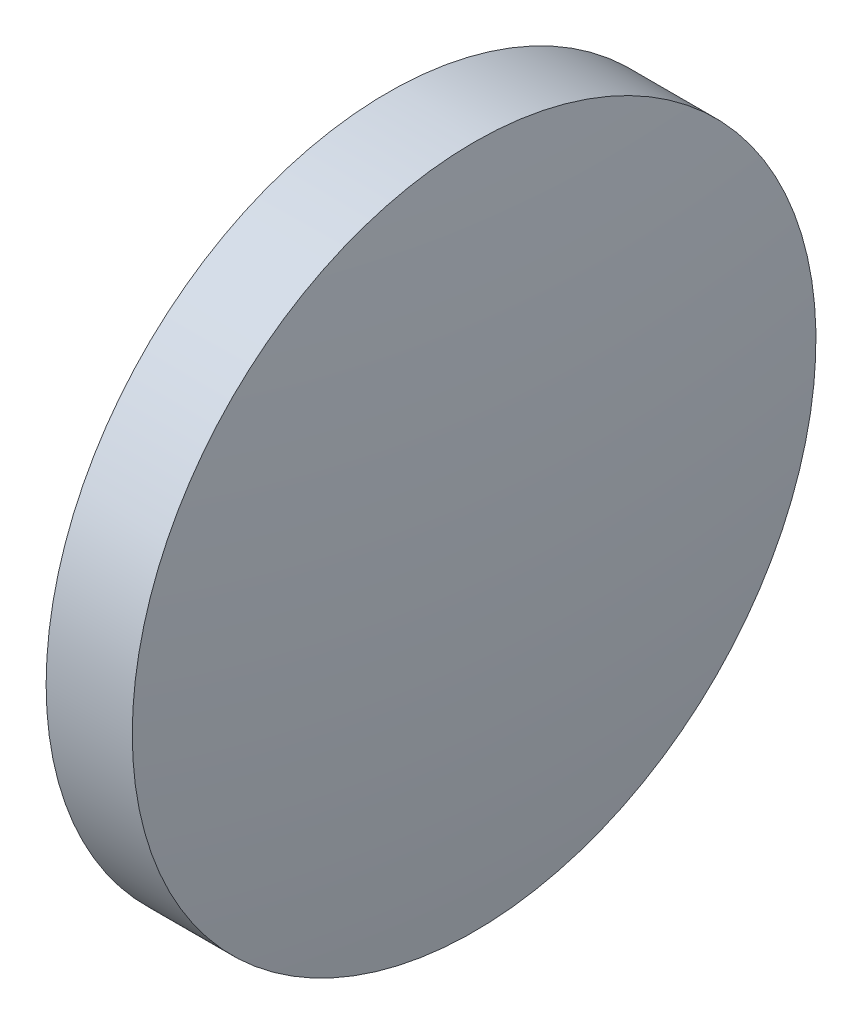
ISO-10303-21;
HEADER;
FILE_DESCRIPTION(('STEP AP214'),'2;1');
FILE_NAME('part.step','',(''),(''),'','','');
FILE_SCHEMA(('AUTOMOTIVE_DESIGN { 1 0 10303 214 1 1 1 1 }'));
ENDSEC;
DATA;
#1=APPLICATION_CONTEXT('core data for automotive mechanical design processes');
#2=APPLICATION_PROTOCOL_DEFINITION('international standard','automotive_design',2000,#1);
#3=PRODUCT_CONTEXT('',#1,'mechanical');
#4=PRODUCT('Part','Part','',(#3));
#5=PRODUCT_RELATED_PRODUCT_CATEGORY('part','',(#4));
#6=PRODUCT_DEFINITION_FORMATION('','',#4);
#7=PRODUCT_DEFINITION_CONTEXT('part definition',#1,'design');
#8=PRODUCT_DEFINITION('design','',#6,#7);
#9=PRODUCT_DEFINITION_SHAPE('','',#8);
#10=(LENGTH_UNIT() NAMED_UNIT(*) SI_UNIT(.MILLI.,.METRE.));
#11=(NAMED_UNIT(*) PLANE_ANGLE_UNIT() SI_UNIT($,.RADIAN.));
#12=(NAMED_UNIT(*) SI_UNIT($,.STERADIAN.) SOLID_ANGLE_UNIT());
#13=UNCERTAINTY_MEASURE_WITH_UNIT(LENGTH_MEASURE(1.E-05),#10,'distance_accuracy_value','');
#14=(GEOMETRIC_REPRESENTATION_CONTEXT(3) GLOBAL_UNCERTAINTY_ASSIGNED_CONTEXT((#13)) GLOBAL_UNIT_ASSIGNED_CONTEXT((#10,
#11,#12)) REPRESENTATION_CONTEXT('',''));
#15=CARTESIAN_POINT('',(0.,0.,0.));
#16=DIRECTION('',(0.,0.,1.));
#17=DIRECTION('',(1.,0.,0.));
#18=AXIS2_PLACEMENT_3D('',#15,#16,#17);
#19=CARTESIAN_POINT('',(162.541360706172,4.5067260938441,0.));
#20=DIRECTION('',(-1.,0.,0.));
#21=DIRECTION('',(0.,1.,0.));
#22=AXIS2_PLACEMENT_3D('',#19,#20,#21);
#23=SPHERICAL_SURFACE('',#22,50.6031250000002);
#24=CARTESIAN_POINT('',(212.744485706172,4.50672609384414,0.));
#25=DIRECTION('',(-1.,0.,0.));
#26=DIRECTION('',(0.,0.,1.));
#27=AXIS2_PLACEMENT_3D('',#24,#25,#26);
#28=CIRCLE('',#27,6.35);
#29=CARTESIAN_POINT('',(212.744485706172,4.50672609384414,6.35));
#30=VERTEX_POINT('',#29);
#31=EDGE_CURVE('E10',#30,#30,#28,.T.);
#32=ORIENTED_EDGE('',*,*,#31,.F.);
#33=EDGE_LOOP('',(#32));
#34=FACE_BOUND('',#33,.T.);
#35=ADVANCED_FACE('F35',(#34),#23,.T.);
#36=CARTESIAN_POINT('',(208.275376688334,4.50672609384414,0.));
#37=DIRECTION('',(-1.,0.,0.));
#38=DIRECTION('',(0.,0.,1.));
#39=AXIS2_PLACEMENT_3D('',#36,#37,#38);
#40=CYLINDRICAL_SURFACE('',#39,6.35);
#41=CARTESIAN_POINT('',(211.144485706172,4.50672609384414,0.));
#42=DIRECTION('',(-1.,0.,0.));
#43=DIRECTION('',(0.,0.,1.));
#44=AXIS2_PLACEMENT_3D('',#41,#42,#43);
#45=CIRCLE('',#44,6.35);
#46=CARTESIAN_POINT('',(211.144485706172,4.50672609384414,6.35));
#47=VERTEX_POINT('',#46);
#48=EDGE_CURVE('E41',#47,#47,#45,.T.);
#49=ORIENTED_EDGE('',*,*,#48,.F.);
#50=EDGE_LOOP('',(#49));
#51=FACE_BOUND('',#50,.T.);
#52=ORIENTED_EDGE('',*,*,#31,.T.);
#53=EDGE_LOOP('',(#52));
#54=FACE_BOUND('',#53,.T.);
#55=ADVANCED_FACE('F49',(#51,#54),#40,.T.);
#56=CARTESIAN_POINT('',(211.144485706172,4.50672609384414,0.));
#57=DIRECTION('',(1.,0.,0.));
#58=DIRECTION('',(0.,0.,-1.));
#59=AXIS2_PLACEMENT_3D('',#56,#57,#58);
#60=PLANE('',#59);
#61=ORIENTED_EDGE('',*,*,#48,.T.);
#62=EDGE_LOOP('',(#61));
#63=FACE_BOUND('',#62,.T.);
#64=ADVANCED_FACE('F47',(#63),#60,.F.);
#65=CLOSED_SHELL('',(#35,#55,#64));
#66=MANIFOLD_SOLID_BREP('B2',#65);
#67=ADVANCED_BREP_SHAPE_REPRESENTATION('',(#18,#66),#14);
#68=SHAPE_DEFINITION_REPRESENTATION(#9,#67);
ENDSEC;
END-ISO-10303-21;
